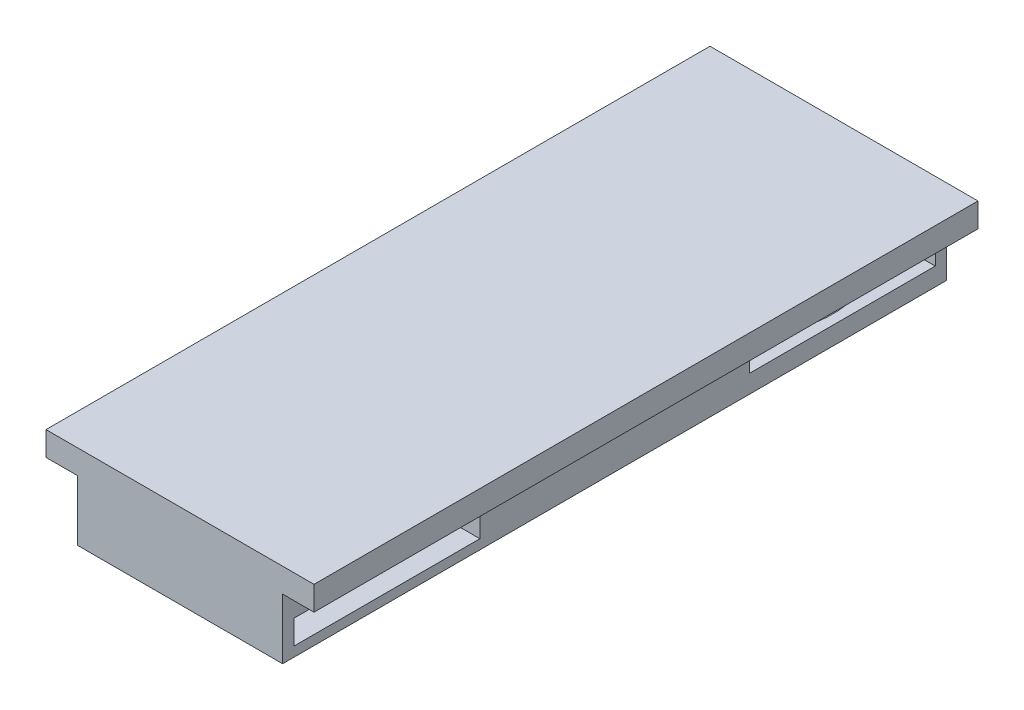
ISO-10303-21;
HEADER;
FILE_DESCRIPTION(('STEP AP214'),'2;1');
FILE_NAME('part.step','',(''),(''),'','','');
FILE_SCHEMA(('AUTOMOTIVE_DESIGN { 1 0 10303 214 1 1 1 1 }'));
ENDSEC;
DATA;
#1=APPLICATION_CONTEXT('core data for automotive mechanical design processes');
#2=APPLICATION_PROTOCOL_DEFINITION('international standard','automotive_design',2000,#1);
#3=PRODUCT_CONTEXT('',#1,'mechanical');
#4=PRODUCT('Part','Part','',(#3));
#5=PRODUCT_RELATED_PRODUCT_CATEGORY('part','',(#4));
#6=PRODUCT_DEFINITION_FORMATION('','',#4);
#7=PRODUCT_DEFINITION_CONTEXT('part definition',#1,'design');
#8=PRODUCT_DEFINITION('design','',#6,#7);
#9=PRODUCT_DEFINITION_SHAPE('','',#8);
#10=(LENGTH_UNIT() NAMED_UNIT(*) SI_UNIT(.MILLI.,.METRE.));
#11=(NAMED_UNIT(*) PLANE_ANGLE_UNIT() SI_UNIT($,.RADIAN.));
#12=(NAMED_UNIT(*) SI_UNIT($,.STERADIAN.) SOLID_ANGLE_UNIT());
#13=UNCERTAINTY_MEASURE_WITH_UNIT(LENGTH_MEASURE(1.E-05),#10,'distance_accuracy_value','');
#14=(GEOMETRIC_REPRESENTATION_CONTEXT(3) GLOBAL_UNCERTAINTY_ASSIGNED_CONTEXT((#13)) GLOBAL_UNIT_ASSIGNED_CONTEXT((#10,
#11,#12)) REPRESENTATION_CONTEXT('',''));
#15=CARTESIAN_POINT('',(0.,0.,0.));
#16=DIRECTION('',(0.,0.,1.));
#17=DIRECTION('',(1.,0.,0.));
#18=AXIS2_PLACEMENT_3D('',#15,#16,#17);
#19=CARTESIAN_POINT('',(11.1,1.01920592299446,-8.64));
#20=DIRECTION('',(0.,-1.,0.));
#21=DIRECTION('',(0.,0.,-1.));
#22=AXIS2_PLACEMENT_3D('',#19,#20,#21);
#23=CYLINDRICAL_SURFACE('',#22,7.7);
#24=DIRECTION('',(0.,-1.,0.));
#25=VECTOR('',#24,1.);
#26=CARTESIAN_POINT('',(11.1,1.01920592299446,-0.940000000000003));
#27=LINE('',#26,#25);
#28=CARTESIAN_POINT('',(11.1,1.01920592299446,-0.940000000000003));
#29=VERTEX_POINT('',#28);
#30=CARTESIAN_POINT('',(11.1,-0.980794077005543,-0.940000000000003));
#31=VERTEX_POINT('',#30);
#32=EDGE_CURVE('E160',#29,#31,#27,.T.);
#33=ORIENTED_EDGE('',*,*,#32,.T.);
#34=CARTESIAN_POINT('',(11.1,-0.980794077005544,-8.64));
#35=DIRECTION('',(0.,-1.,0.));
#36=DIRECTION('',(0.,0.,-1.));
#37=AXIS2_PLACEMENT_3D('',#34,#35,#36);
#38=CIRCLE('',#37,7.7);
#39=CARTESIAN_POINT('',(11.1,-0.980794077005543,-16.34));
#40=VERTEX_POINT('',#39);
#41=EDGE_CURVE('E173',#40,#31,#38,.F.);
#42=ORIENTED_EDGE('',*,*,#41,.F.);
#43=DIRECTION('',(0.,1.,0.));
#44=VECTOR('',#43,1.);
#45=CARTESIAN_POINT('',(11.1,1.01920592299446,-16.34));
#46=LINE('',#45,#44);
#47=CARTESIAN_POINT('',(11.1,1.01920592299446,-16.34));
#48=VERTEX_POINT('',#47);
#49=EDGE_CURVE('E168',#40,#48,#46,.T.);
#50=ORIENTED_EDGE('',*,*,#49,.T.);
#51=CARTESIAN_POINT('',(11.1,1.01920592299446,-8.64));
#52=DIRECTION('',(0.,-1.,0.));
#53=DIRECTION('',(0.,0.,-1.));
#54=AXIS2_PLACEMENT_3D('',#51,#52,#53);
#55=CIRCLE('',#54,7.7);
#56=EDGE_CURVE('E175',#29,#48,#55,.T.);
#57=ORIENTED_EDGE('',*,*,#56,.F.);
#58=EDGE_LOOP('',(#33,#42,#50,#57));
#59=FACE_BOUND('',#58,.T.);
#60=ADVANCED_FACE('F39',(#59),#23,.F.);
#61=CARTESIAN_POINT('',(11.1,1.01920592299446,-46.36));
#62=DIRECTION('',(0.,-1.,0.));
#63=DIRECTION('',(0.,0.,-1.));
#64=AXIS2_PLACEMENT_3D('',#61,#62,#63);
#65=PLANE('',#64);
#66=CARTESIAN_POINT('',(11.1,1.01920592299446,-46.36));
#67=DIRECTION('',(0.,-1.,0.));
#68=DIRECTION('',(0.,0.,-1.));
#69=AXIS2_PLACEMENT_3D('',#66,#67,#68);
#70=CIRCLE('',#69,7.7);
#71=CARTESIAN_POINT('',(11.1,1.01920592299446,-38.66));
#72=VERTEX_POINT('',#71);
#73=CARTESIAN_POINT('',(11.1,1.01920592299446,-54.06));
#74=VERTEX_POINT('',#73);
#75=EDGE_CURVE('E242',#72,#74,#70,.T.);
#76=ORIENTED_EDGE('',*,*,#75,.T.);
#77=DIRECTION('',(0.,0.,1.));
#78=VECTOR('',#77,1.);
#79=CARTESIAN_POINT('',(11.1,1.01920592299446,-46.36));
#80=LINE('',#79,#78);
#81=EDGE_CURVE('E224',#74,#72,#80,.T.);
#82=ORIENTED_EDGE('',*,*,#81,.T.);
#83=EDGE_LOOP('',(#76,#82));
#84=FACE_BOUND('',#83,.T.);
#85=ADVANCED_FACE('F375',(#84),#65,.T.);
#86=CARTESIAN_POINT('',(11.1,1.01920592299446,-46.36));
#87=DIRECTION('',(0.,-1.,0.));
#88=DIRECTION('',(0.,0.,-1.));
#89=AXIS2_PLACEMENT_3D('',#86,#87,#88);
#90=CYLINDRICAL_SURFACE('',#89,7.7);
#91=CARTESIAN_POINT('',(11.1,-0.980794077005544,-46.36));
#92=DIRECTION('',(0.,-1.,0.));
#93=DIRECTION('',(0.,0.,-1.));
#94=AXIS2_PLACEMENT_3D('',#91,#92,#93);
#95=CIRCLE('',#94,7.7);
#96=CARTESIAN_POINT('',(11.1,-0.980794077005544,-54.06));
#97=VERTEX_POINT('',#96);
#98=EDGE_CURVE('E182',#97,#97,#95,.F.);
#99=ORIENTED_EDGE('',*,*,#98,.F.);
#100=EDGE_LOOP('',(#99));
#101=FACE_BOUND('',#100,.T.);
#102=DIRECTION('',(0.,-1.,0.));
#103=VECTOR('',#102,1.);
#104=CARTESIAN_POINT('',(11.1,1.01920592299446,-38.66));
#105=LINE('',#104,#103);
#106=CARTESIAN_POINT('',(11.1,-0.280794077005543,-38.66));
#107=VERTEX_POINT('',#106);
#108=EDGE_CURVE('E11',#107,#72,#105,.F.);
#109=ORIENTED_EDGE('',*,*,#108,.F.);
#110=CARTESIAN_POINT('',(11.1,-0.280794077005543,-46.36));
#111=DIRECTION('',(0.,-1.,0.));
#112=DIRECTION('',(0.,0.,-1.));
#113=AXIS2_PLACEMENT_3D('',#110,#111,#112);
#114=CIRCLE('',#113,7.7);
#115=CARTESIAN_POINT('',(11.1,-0.280794077005543,-54.06));
#116=VERTEX_POINT('',#115);
#117=EDGE_CURVE('E48',#107,#116,#114,.F.);
#118=ORIENTED_EDGE('',*,*,#117,.T.);
#119=DIRECTION('',(0.,1.,0.));
#120=VECTOR('',#119,1.);
#121=CARTESIAN_POINT('',(11.1,1.71920592299446,-54.06));
#122=LINE('',#121,#120);
#123=EDGE_CURVE('E202',#116,#74,#122,.T.);
#124=ORIENTED_EDGE('',*,*,#123,.T.);
#125=ORIENTED_EDGE('',*,*,#75,.F.);
#126=EDGE_LOOP('',(#109,#118,#124,#125));
#127=FACE_BOUND('',#126,.T.);
#128=ADVANCED_FACE('F199',(#101,#127),#90,.F.);
#129=CARTESIAN_POINT('',(2.6,-1.78079407700554,-55.));
#130=DIRECTION('',(-1.,0.,0.));
#131=DIRECTION('',(0.,-1.,0.));
#132=AXIS2_PLACEMENT_3D('',#129,#130,#131);
#133=PLANE('',#132);
#134=DIRECTION('',(0.,-1.,0.));
#135=VECTOR('',#134,1.);
#136=CARTESIAN_POINT('',(2.6,-1.78079407700554,0.));
#137=LINE('',#136,#135);
#138=CARTESIAN_POINT('',(2.6,3.21920592299446,0.));
#139=VERTEX_POINT('',#138);
#140=CARTESIAN_POINT('',(2.6,-1.78079407700554,0.));
#141=VERTEX_POINT('',#140);
#142=EDGE_CURVE('E248',#139,#141,#137,.T.);
#143=ORIENTED_EDGE('',*,*,#142,.F.);
#144=DIRECTION('',(0.,0.,1.));
#145=VECTOR('',#144,1.);
#146=CARTESIAN_POINT('',(2.6,3.21920592299446,-55.));
#147=LINE('',#146,#145);
#148=CARTESIAN_POINT('',(2.6,3.21920592299446,-55.));
#149=VERTEX_POINT('',#148);
#150=EDGE_CURVE('E183',#149,#139,#147,.T.);
#151=ORIENTED_EDGE('',*,*,#150,.F.);
#152=DIRECTION('',(0.,-1.,0.));
#153=VECTOR('',#152,1.);
#154=CARTESIAN_POINT('',(2.6,-1.78079407700554,-55.));
#155=LINE('',#154,#153);
#156=CARTESIAN_POINT('',(2.6,-1.78079407700554,-55.));
#157=VERTEX_POINT('',#156);
#158=EDGE_CURVE('E251',#149,#157,#155,.T.);
#159=ORIENTED_EDGE('',*,*,#158,.T.);
#160=DIRECTION('',(0.,0.,1.));
#161=VECTOR('',#160,1.);
#162=CARTESIAN_POINT('',(2.6,-1.78079407700554,-55.));
#163=LINE('',#162,#161);
#164=EDGE_CURVE('E192',#157,#141,#163,.T.);
#165=ORIENTED_EDGE('',*,*,#164,.T.);
#166=EDGE_LOOP('',(#143,#151,#159,#165));
#167=FACE_BOUND('',#166,.T.);
#168=ADVANCED_FACE('F41',(#167),#133,.T.);
#169=CARTESIAN_POINT('',(2.6,3.21920592299446,-55.));
#170=DIRECTION('',(0.,-1.,0.));
#171=DIRECTION('',(1.,0.,0.));
#172=AXIS2_PLACEMENT_3D('',#169,#170,#171);
#173=PLANE('',#172);
#174=DIRECTION('',(1.,0.,0.));
#175=VECTOR('',#174,1.);
#176=CARTESIAN_POINT('',(2.6,3.21920592299446,0.));
#177=LINE('',#176,#175);
#178=CARTESIAN_POINT('',(0.,3.21920592299446,0.));
#179=VERTEX_POINT('',#178);
#180=EDGE_CURVE('E256',#179,#139,#177,.T.);
#181=ORIENTED_EDGE('',*,*,#180,.F.);
#182=DIRECTION('',(0.,0.,1.));
#183=VECTOR('',#182,1.);
#184=CARTESIAN_POINT('',(0.,3.21920592299446,-55.));
#185=LINE('',#184,#183);
#186=CARTESIAN_POINT('',(0.,3.21920592299446,-55.));
#187=VERTEX_POINT('',#186);
#188=EDGE_CURVE('E189',#187,#179,#185,.T.);
#189=ORIENTED_EDGE('',*,*,#188,.F.);
#190=DIRECTION('',(1.,0.,0.));
#191=VECTOR('',#190,1.);
#192=CARTESIAN_POINT('',(2.6,3.21920592299446,-55.));
#193=LINE('',#192,#191);
#194=EDGE_CURVE('E280',#187,#149,#193,.T.);
#195=ORIENTED_EDGE('',*,*,#194,.T.);
#196=ORIENTED_EDGE('',*,*,#150,.T.);
#197=EDGE_LOOP('',(#181,#189,#195,#196));
#198=FACE_BOUND('',#197,.T.);
#199=ADVANCED_FACE('F344',(#198),#173,.T.);
#200=CARTESIAN_POINT('',(0.,3.21920592299446,-55.));
#201=DIRECTION('',(-1.,0.,0.));
#202=DIRECTION('',(0.,0.,1.));
#203=AXIS2_PLACEMENT_3D('',#200,#201,#202);
#204=PLANE('',#203);
#205=DIRECTION('',(0.,-1.,0.));
#206=VECTOR('',#205,1.);
#207=CARTESIAN_POINT('',(0.,3.21920592299446,0.));
#208=LINE('',#207,#206);
#209=CARTESIAN_POINT('',(0.,5.21920592299446,0.));
#210=VERTEX_POINT('',#209);
#211=EDGE_CURVE('E307',#210,#179,#208,.T.);
#212=ORIENTED_EDGE('',*,*,#211,.F.);
#213=DIRECTION('',(0.,0.,1.));
#214=VECTOR('',#213,1.);
#215=CARTESIAN_POINT('',(0.,5.21920592299446,-55.));
#216=LINE('',#215,#214);
#217=CARTESIAN_POINT('',(0.,5.21920592299446,-55.));
#218=VERTEX_POINT('',#217);
#219=EDGE_CURVE('E316',#218,#210,#216,.T.);
#220=ORIENTED_EDGE('',*,*,#219,.F.);
#221=DIRECTION('',(0.,-1.,0.));
#222=VECTOR('',#221,1.);
#223=CARTESIAN_POINT('',(0.,3.21920592299446,-55.));
#224=LINE('',#223,#222);
#225=EDGE_CURVE('E276',#218,#187,#224,.T.);
#226=ORIENTED_EDGE('',*,*,#225,.T.);
#227=ORIENTED_EDGE('',*,*,#188,.T.);
#228=EDGE_LOOP('',(#212,#220,#226,#227));
#229=FACE_BOUND('',#228,.T.);
#230=ADVANCED_FACE('F365',(#229),#204,.T.);
#231=CARTESIAN_POINT('',(0.,5.21920592299446,-55.));
#232=DIRECTION('',(0.,1.,0.));
#233=DIRECTION('',(-1.,0.,0.));
#234=AXIS2_PLACEMENT_3D('',#231,#232,#233);
#235=PLANE('',#234);
#236=DIRECTION('',(-1.,0.,0.));
#237=VECTOR('',#236,1.);
#238=CARTESIAN_POINT('',(0.,5.21920592299446,0.));
#239=LINE('',#238,#237);
#240=CARTESIAN_POINT('',(22.2,5.21920592299446,0.));
#241=VERTEX_POINT('',#240);
#242=EDGE_CURVE('E303',#241,#210,#239,.T.);
#243=ORIENTED_EDGE('',*,*,#242,.F.);
#244=DIRECTION('',(0.,0.,1.));
#245=VECTOR('',#244,1.);
#246=CARTESIAN_POINT('',(22.2,5.21920592299446,-55.));
#247=LINE('',#246,#245);
#248=CARTESIAN_POINT('',(22.2,5.21920592299446,-55.));
#249=VERTEX_POINT('',#248);
#250=EDGE_CURVE('E319',#249,#241,#247,.T.);
#251=ORIENTED_EDGE('',*,*,#250,.F.);
#252=DIRECTION('',(-1.,0.,0.));
#253=VECTOR('',#252,1.);
#254=CARTESIAN_POINT('',(0.,5.21920592299446,-55.));
#255=LINE('',#254,#253);
#256=EDGE_CURVE('E272',#249,#218,#255,.T.);
#257=ORIENTED_EDGE('',*,*,#256,.T.);
#258=ORIENTED_EDGE('',*,*,#219,.T.);
#259=EDGE_LOOP('',(#243,#251,#257,#258));
#260=FACE_BOUND('',#259,.T.);
#261=ADVANCED_FACE('F363',(#260),#235,.T.);
#262=CARTESIAN_POINT('',(22.2,5.21920592299446,-55.));
#263=DIRECTION('',(1.,0.,0.));
#264=DIRECTION('',(0.,0.,-1.));
#265=AXIS2_PLACEMENT_3D('',#262,#263,#264);
#266=PLANE('',#265);
#267=DIRECTION('',(0.,1.,0.));
#268=VECTOR('',#267,1.);
#269=CARTESIAN_POINT('',(22.2,5.21920592299446,0.));
#270=LINE('',#269,#268);
#271=CARTESIAN_POINT('',(22.2,3.21920592299446,0.));
#272=VERTEX_POINT('',#271);
#273=EDGE_CURVE('E299',#272,#241,#270,.T.);
#274=ORIENTED_EDGE('',*,*,#273,.F.);
#275=DIRECTION('',(0.,0.,1.));
#276=VECTOR('',#275,1.);
#277=CARTESIAN_POINT('',(22.2,3.21920592299446,-55.));
#278=LINE('',#277,#276);
#279=CARTESIAN_POINT('',(22.2,3.21920592299446,-55.));
#280=VERTEX_POINT('',#279);
#281=EDGE_CURVE('E322',#280,#272,#278,.T.);
#282=ORIENTED_EDGE('',*,*,#281,.F.);
#283=DIRECTION('',(0.,1.,0.));
#284=VECTOR('',#283,1.);
#285=CARTESIAN_POINT('',(22.2,5.21920592299446,-55.));
#286=LINE('',#285,#284);
#287=EDGE_CURVE('E268',#280,#249,#286,.T.);
#288=ORIENTED_EDGE('',*,*,#287,.T.);
#289=ORIENTED_EDGE('',*,*,#250,.T.);
#290=EDGE_LOOP('',(#274,#282,#288,#289));
#291=FACE_BOUND('',#290,.T.);
#292=ADVANCED_FACE('F359',(#291),#266,.T.);
#293=CARTESIAN_POINT('',(22.2,3.21920592299446,-55.));
#294=DIRECTION('',(0.,-1.,0.));
#295=DIRECTION('',(1.,0.,0.));
#296=AXIS2_PLACEMENT_3D('',#293,#294,#295);
#297=PLANE('',#296);
#298=DIRECTION('',(1.,0.,0.));
#299=VECTOR('',#298,1.);
#300=CARTESIAN_POINT('',(22.2,3.21920592299446,0.));
#301=LINE('',#300,#299);
#302=CARTESIAN_POINT('',(19.6,3.21920592299446,0.));
#303=VERTEX_POINT('',#302);
#304=EDGE_CURVE('E295',#303,#272,#301,.T.);
#305=ORIENTED_EDGE('',*,*,#304,.F.);
#306=DIRECTION('',(0.,0.,1.));
#307=VECTOR('',#306,1.);
#308=CARTESIAN_POINT('',(19.6,3.21920592299446,-55.));
#309=LINE('',#308,#307);
#310=CARTESIAN_POINT('',(19.6,3.21920592299446,-55.));
#311=VERTEX_POINT('',#310);
#312=EDGE_CURVE('E325',#311,#303,#309,.T.);
#313=ORIENTED_EDGE('',*,*,#312,.F.);
#314=DIRECTION('',(1.,0.,0.));
#315=VECTOR('',#314,1.);
#316=CARTESIAN_POINT('',(22.2,3.21920592299446,-55.));
#317=LINE('',#316,#315);
#318=EDGE_CURVE('E264',#311,#280,#317,.T.);
#319=ORIENTED_EDGE('',*,*,#318,.T.);
#320=ORIENTED_EDGE('',*,*,#281,.T.);
#321=EDGE_LOOP('',(#305,#313,#319,#320));
#322=FACE_BOUND('',#321,.T.);
#323=ADVANCED_FACE('F357',(#322),#297,.T.);
#324=CARTESIAN_POINT('',(19.6,-1.78079407700554,-55.));
#325=DIRECTION('',(1.,0.,0.));
#326=DIRECTION('',(0.,0.,-1.));
#327=AXIS2_PLACEMENT_3D('',#324,#325,#326);
#328=PLANE('',#327);
#329=DIRECTION('',(0.,-1.,0.));
#330=VECTOR('',#329,1.);
#331=CARTESIAN_POINT('',(19.6,1.01920592299446,-0.940000000000003));
#332=LINE('',#331,#330);
#333=CARTESIAN_POINT('',(19.6,1.01920592299446,-0.940000000000003));
#334=VERTEX_POINT('',#333);
#335=CARTESIAN_POINT('',(19.6,-0.980794077005543,-0.940000000000003));
#336=VERTEX_POINT('',#335);
#337=EDGE_CURVE('E55',#334,#336,#332,.T.);
#338=ORIENTED_EDGE('',*,*,#337,.F.);
#339=DIRECTION('',(0.,0.,1.));
#340=VECTOR('',#339,1.);
#341=CARTESIAN_POINT('',(19.6,1.01920592299446,-0.940000000000003));
#342=LINE('',#341,#340);
#343=CARTESIAN_POINT('',(19.6,1.01920592299446,-16.34));
#344=VERTEX_POINT('',#343);
#345=EDGE_CURVE('E177',#344,#334,#342,.T.);
#346=ORIENTED_EDGE('',*,*,#345,.F.);
#347=DIRECTION('',(0.,1.,0.));
#348=VECTOR('',#347,1.);
#349=CARTESIAN_POINT('',(19.6,1.01920592299446,-16.34));
#350=LINE('',#349,#348);
#351=CARTESIAN_POINT('',(19.6,-0.980794077005543,-16.34));
#352=VERTEX_POINT('',#351);
#353=EDGE_CURVE('E436',#352,#344,#350,.T.);
#354=ORIENTED_EDGE('',*,*,#353,.F.);
#355=DIRECTION('',(0.,0.,-1.));
#356=VECTOR('',#355,1.);
#357=CARTESIAN_POINT('',(19.6,-0.980794077005543,-0.940000000000003));
#358=LINE('',#357,#356);
#359=EDGE_CURVE('E441',#336,#352,#358,.T.);
#360=ORIENTED_EDGE('',*,*,#359,.F.);
#361=EDGE_LOOP('',(#338,#346,#354,#360));
#362=FACE_BOUND('',#361,.T.);
#363=DIRECTION('',(0.,-1.,0.));
#364=VECTOR('',#363,1.);
#365=CARTESIAN_POINT('',(19.6,1.71920592299446,-38.66));
#366=LINE('',#365,#364);
#367=CARTESIAN_POINT('',(19.6,1.71920592299446,-38.66));
#368=VERTEX_POINT('',#367);
#369=CARTESIAN_POINT('',(19.6,-0.280794077005543,-38.66));
#370=VERTEX_POINT('',#369);
#371=EDGE_CURVE('E63',#368,#370,#366,.T.);
#372=ORIENTED_EDGE('',*,*,#371,.F.);
#373=DIRECTION('',(0.,0.,1.));
#374=VECTOR('',#373,1.);
#375=CARTESIAN_POINT('',(19.6,1.71920592299446,-38.66));
#376=LINE('',#375,#374);
#377=CARTESIAN_POINT('',(19.6,1.71920592299446,-54.06));
#378=VERTEX_POINT('',#377);
#379=EDGE_CURVE('E460',#378,#368,#376,.T.);
#380=ORIENTED_EDGE('',*,*,#379,.F.);
#381=DIRECTION('',(0.,1.,0.));
#382=VECTOR('',#381,1.);
#383=CARTESIAN_POINT('',(19.6,1.71920592299446,-54.06));
#384=LINE('',#383,#382);
#385=CARTESIAN_POINT('',(19.6,-0.280794077005543,-54.06));
#386=VERTEX_POINT('',#385);
#387=EDGE_CURVE('E468',#386,#378,#384,.T.);
#388=ORIENTED_EDGE('',*,*,#387,.F.);
#389=DIRECTION('',(0.,0.,-1.));
#390=VECTOR('',#389,1.);
#391=CARTESIAN_POINT('',(19.6,-0.280794077005543,-38.66));
#392=LINE('',#391,#390);
#393=EDGE_CURVE('E465',#370,#386,#392,.T.);
#394=ORIENTED_EDGE('',*,*,#393,.F.);
#395=EDGE_LOOP('',(#372,#380,#388,#394));
#396=FACE_BOUND('',#395,.T.);
#397=DIRECTION('',(0.,1.,0.));
#398=VECTOR('',#397,1.);
#399=CARTESIAN_POINT('',(19.6,-1.78079407700554,0.));
#400=LINE('',#399,#398);
#401=CARTESIAN_POINT('',(19.6,-1.78079407700554,0.));
#402=VERTEX_POINT('',#401);
#403=EDGE_CURVE('E291',#402,#303,#400,.T.);
#404=ORIENTED_EDGE('',*,*,#403,.F.);
#405=DIRECTION('',(0.,0.,1.));
#406=VECTOR('',#405,1.);
#407=CARTESIAN_POINT('',(19.6,-1.78079407700554,-55.));
#408=LINE('',#407,#406);
#409=CARTESIAN_POINT('',(19.6,-1.78079407700554,-55.));
#410=VERTEX_POINT('',#409);
#411=EDGE_CURVE('E327',#410,#402,#408,.T.);
#412=ORIENTED_EDGE('',*,*,#411,.F.);
#413=DIRECTION('',(0.,1.,0.));
#414=VECTOR('',#413,1.);
#415=CARTESIAN_POINT('',(19.6,-1.78079407700554,-55.));
#416=LINE('',#415,#414);
#417=EDGE_CURVE('E260',#410,#311,#416,.T.);
#418=ORIENTED_EDGE('',*,*,#417,.T.);
#419=ORIENTED_EDGE('',*,*,#312,.T.);
#420=EDGE_LOOP('',(#404,#412,#418,#419));
#421=FACE_BOUND('',#420,.T.);
#422=ADVANCED_FACE('F353',(#362,#396,#421),#328,.T.);
#423=CARTESIAN_POINT('',(2.6,-1.78079407700554,-55.));
#424=DIRECTION('',(0.,-1.,0.));
#425=DIRECTION('',(1.,0.,0.));
#426=AXIS2_PLACEMENT_3D('',#423,#424,#425);
#427=PLANE('',#426);
#428=DIRECTION('',(1.,0.,0.));
#429=VECTOR('',#428,1.);
#430=CARTESIAN_POINT('',(2.6,-1.78079407700554,0.));
#431=LINE('',#430,#429);
#432=EDGE_CURVE('E287',#141,#402,#431,.T.);
#433=ORIENTED_EDGE('',*,*,#432,.F.);
#434=ORIENTED_EDGE('',*,*,#164,.F.);
#435=DIRECTION('',(1.,0.,0.));
#436=VECTOR('',#435,1.);
#437=CARTESIAN_POINT('',(2.6,-1.78079407700554,-55.));
#438=LINE('',#437,#436);
#439=EDGE_CURVE('E255',#157,#410,#438,.T.);
#440=ORIENTED_EDGE('',*,*,#439,.T.);
#441=ORIENTED_EDGE('',*,*,#411,.T.);
#442=EDGE_LOOP('',(#433,#434,#440,#441));
#443=FACE_BOUND('',#442,.T.);
#444=CARTESIAN_POINT('',(11.1,-1.78079407700554,-8.64));
#445=DIRECTION('',(0.,-1.,0.));
#446=DIRECTION('',(0.,0.,-1.));
#447=AXIS2_PLACEMENT_3D('',#444,#445,#446);
#448=CIRCLE('',#447,5.5);
#449=CARTESIAN_POINT('',(11.1,-1.78079407700554,-14.14));
#450=VERTEX_POINT('',#449);
#451=EDGE_CURVE('E234',#450,#450,#448,.T.);
#452=ORIENTED_EDGE('',*,*,#451,.F.);
#453=EDGE_LOOP('',(#452));
#454=FACE_BOUND('',#453,.T.);
#455=CARTESIAN_POINT('',(11.1,-1.78079407700554,-46.36));
#456=DIRECTION('',(0.,-1.,0.));
#457=DIRECTION('',(0.,0.,-1.));
#458=AXIS2_PLACEMENT_3D('',#455,#456,#457);
#459=CIRCLE('',#458,5.5);
#460=CARTESIAN_POINT('',(11.1,-1.78079407700554,-51.86));
#461=VERTEX_POINT('',#460);
#462=EDGE_CURVE('E228',#461,#461,#459,.T.);
#463=ORIENTED_EDGE('',*,*,#462,.F.);
#464=EDGE_LOOP('',(#463));
#465=FACE_BOUND('',#464,.T.);
#466=ADVANCED_FACE('F337',(#443,#454,#465),#427,.T.);
#467=CARTESIAN_POINT('',(0.,0.,-55.));
#468=DIRECTION('',(0.,0.,1.));
#469=DIRECTION('',(1.,0.,0.));
#470=AXIS2_PLACEMENT_3D('',#467,#468,#469);
#471=PLANE('',#470);
#472=ORIENTED_EDGE('',*,*,#158,.F.);
#473=ORIENTED_EDGE('',*,*,#194,.F.);
#474=ORIENTED_EDGE('',*,*,#225,.F.);
#475=ORIENTED_EDGE('',*,*,#256,.F.);
#476=ORIENTED_EDGE('',*,*,#287,.F.);
#477=ORIENTED_EDGE('',*,*,#318,.F.);
#478=ORIENTED_EDGE('',*,*,#417,.F.);
#479=ORIENTED_EDGE('',*,*,#439,.F.);
#480=EDGE_LOOP('',(#472,#473,#474,#475,#476,#477,#478,#479));
#481=FACE_BOUND('',#480,.T.);
#482=ADVANCED_FACE('F347',(#481),#471,.F.);
#483=CARTESIAN_POINT('',(0.,0.,0.));
#484=DIRECTION('',(0.,0.,1.));
#485=DIRECTION('',(1.,0.,0.));
#486=AXIS2_PLACEMENT_3D('',#483,#484,#485);
#487=PLANE('',#486);
#488=ORIENTED_EDGE('',*,*,#142,.T.);
#489=ORIENTED_EDGE('',*,*,#432,.T.);
#490=ORIENTED_EDGE('',*,*,#403,.T.);
#491=ORIENTED_EDGE('',*,*,#304,.T.);
#492=ORIENTED_EDGE('',*,*,#273,.T.);
#493=ORIENTED_EDGE('',*,*,#242,.T.);
#494=ORIENTED_EDGE('',*,*,#211,.T.);
#495=ORIENTED_EDGE('',*,*,#180,.T.);
#496=EDGE_LOOP('',(#488,#489,#490,#491,#492,#493,#494,#495));
#497=FACE_BOUND('',#496,.T.);
#498=ADVANCED_FACE('F340',(#497),#487,.T.);
#499=CARTESIAN_POINT('',(11.1,-0.980794077005544,-8.64));
#500=DIRECTION('',(0.,-1.,0.));
#501=DIRECTION('',(0.,0.,-1.));
#502=AXIS2_PLACEMENT_3D('',#499,#500,#501);
#503=PLANE('',#502);
#504=CARTESIAN_POINT('',(11.1,-0.980794077005544,-8.64));
#505=DIRECTION('',(0.,-1.,0.));
#506=DIRECTION('',(0.,0.,-1.));
#507=AXIS2_PLACEMENT_3D('',#504,#505,#506);
#508=CIRCLE('',#507,5.5);
#509=CARTESIAN_POINT('',(11.1,-0.980794077005544,-14.14));
#510=VERTEX_POINT('',#509);
#511=EDGE_CURVE('E238',#510,#510,#508,.T.);
#512=ORIENTED_EDGE('',*,*,#511,.T.);
#513=EDGE_LOOP('',(#512));
#514=FACE_BOUND('',#513,.T.);
#515=DIRECTION('',(1.,0.,0.));
#516=VECTOR('',#515,1.);
#517=CARTESIAN_POINT('',(11.1,-0.980794077005543,-16.34));
#518=LINE('',#517,#516);
#519=EDGE_CURVE('E167',#40,#352,#518,.T.);
#520=ORIENTED_EDGE('',*,*,#519,.F.);
#521=ORIENTED_EDGE('',*,*,#41,.T.);
#522=DIRECTION('',(1.,0.,0.));
#523=VECTOR('',#522,1.);
#524=CARTESIAN_POINT('',(11.1,-0.980794077005543,-0.940000000000003));
#525=LINE('',#524,#523);
#526=EDGE_CURVE('E157',#31,#336,#525,.T.);
#527=ORIENTED_EDGE('',*,*,#526,.T.);
#528=ORIENTED_EDGE('',*,*,#359,.T.);
#529=EDGE_LOOP('',(#520,#521,#527,#528));
#530=FACE_BOUND('',#529,.T.);
#531=ADVANCED_FACE('F179',(#514,#530),#503,.F.);
#532=CARTESIAN_POINT('',(11.1,-0.980794077005544,-8.64));
#533=DIRECTION('',(0.,-1.,0.));
#534=DIRECTION('',(0.,0.,-1.));
#535=AXIS2_PLACEMENT_3D('',#532,#533,#534);
#536=CYLINDRICAL_SURFACE('',#535,5.5);
#537=ORIENTED_EDGE('',*,*,#511,.F.);
#538=EDGE_LOOP('',(#537));
#539=FACE_BOUND('',#538,.T.);
#540=ORIENTED_EDGE('',*,*,#451,.T.);
#541=EDGE_LOOP('',(#540));
#542=FACE_BOUND('',#541,.T.);
#543=ADVANCED_FACE('F395',(#539,#542),#536,.F.);
#544=CARTESIAN_POINT('',(11.1,1.01920592299446,-8.64));
#545=DIRECTION('',(0.,-1.,0.));
#546=DIRECTION('',(0.,0.,-1.));
#547=AXIS2_PLACEMENT_3D('',#544,#545,#546);
#548=PLANE('',#547);
#549=DIRECTION('',(1.,0.,0.));
#550=VECTOR('',#549,1.);
#551=CARTESIAN_POINT('',(11.1,1.01920592299446,-0.940000000000003));
#552=LINE('',#551,#550);
#553=EDGE_CURVE('E229',#29,#334,#552,.T.);
#554=ORIENTED_EDGE('',*,*,#553,.F.);
#555=ORIENTED_EDGE('',*,*,#56,.T.);
#556=DIRECTION('',(1.,0.,0.));
#557=VECTOR('',#556,1.);
#558=CARTESIAN_POINT('',(11.1,1.01920592299446,-16.34));
#559=LINE('',#558,#557);
#560=EDGE_CURVE('E438',#48,#344,#559,.T.);
#561=ORIENTED_EDGE('',*,*,#560,.T.);
#562=ORIENTED_EDGE('',*,*,#345,.T.);
#563=EDGE_LOOP('',(#554,#555,#561,#562));
#564=FACE_BOUND('',#563,.T.);
#565=ADVANCED_FACE('F383',(#564),#548,.T.);
#566=CARTESIAN_POINT('',(11.1,-0.980794077005544,-46.36));
#567=DIRECTION('',(0.,-1.,0.));
#568=DIRECTION('',(0.,0.,-1.));
#569=AXIS2_PLACEMENT_3D('',#566,#567,#568);
#570=PLANE('',#569);
#571=CARTESIAN_POINT('',(11.1,-0.980794077005544,-46.36));
#572=DIRECTION('',(0.,-1.,0.));
#573=DIRECTION('',(0.,0.,-1.));
#574=AXIS2_PLACEMENT_3D('',#571,#572,#573);
#575=CIRCLE('',#574,5.5);
#576=CARTESIAN_POINT('',(11.1,-0.980794077005544,-51.86));
#577=VERTEX_POINT('',#576);
#578=EDGE_CURVE('E230',#577,#577,#575,.T.);
#579=ORIENTED_EDGE('',*,*,#578,.T.);
#580=EDGE_LOOP('',(#579));
#581=FACE_BOUND('',#580,.T.);
#582=ORIENTED_EDGE('',*,*,#98,.T.);
#583=EDGE_LOOP('',(#582));
#584=FACE_BOUND('',#583,.T.);
#585=ADVANCED_FACE('F403',(#581,#584),#570,.F.);
#586=CARTESIAN_POINT('',(11.1,-0.980794077005544,-46.36));
#587=DIRECTION('',(0.,-1.,0.));
#588=DIRECTION('',(0.,0.,-1.));
#589=AXIS2_PLACEMENT_3D('',#586,#587,#588);
#590=CYLINDRICAL_SURFACE('',#589,5.5);
#591=ORIENTED_EDGE('',*,*,#578,.F.);
#592=EDGE_LOOP('',(#591));
#593=FACE_BOUND('',#592,.T.);
#594=ORIENTED_EDGE('',*,*,#462,.T.);
#595=EDGE_LOOP('',(#594));
#596=FACE_BOUND('',#595,.T.);
#597=ADVANCED_FACE('F406',(#593,#596),#590,.F.);
#598=CARTESIAN_POINT('',(11.1,-0.280794077005543,-38.66));
#599=DIRECTION('',(0.,-1.,0.));
#600=DIRECTION('',(0.,0.,-1.));
#601=AXIS2_PLACEMENT_3D('',#598,#599,#600);
#602=PLANE('',#601);
#603=DIRECTION('',(1.,0.,0.));
#604=VECTOR('',#603,1.);
#605=CARTESIAN_POINT('',(11.1,-0.280794077005543,-38.66));
#606=LINE('',#605,#604);
#607=EDGE_CURVE('E207',#107,#370,#606,.T.);
#608=ORIENTED_EDGE('',*,*,#607,.T.);
#609=ORIENTED_EDGE('',*,*,#393,.T.);
#610=DIRECTION('',(1.,0.,0.));
#611=VECTOR('',#610,1.);
#612=CARTESIAN_POINT('',(11.1,-0.280794077005543,-54.06));
#613=LINE('',#612,#611);
#614=EDGE_CURVE('E209',#116,#386,#613,.T.);
#615=ORIENTED_EDGE('',*,*,#614,.F.);
#616=ORIENTED_EDGE('',*,*,#117,.F.);
#617=EDGE_LOOP('',(#608,#609,#615,#616));
#618=FACE_BOUND('',#617,.T.);
#619=ADVANCED_FACE('F205',(#618),#602,.F.);
#620=CARTESIAN_POINT('',(11.1,1.71920592299446,-38.66));
#621=DIRECTION('',(0.,0.,1.));
#622=DIRECTION('',(1.,0.,0.));
#623=AXIS2_PLACEMENT_3D('',#620,#621,#622);
#624=PLANE('',#623);
#625=ORIENTED_EDGE('',*,*,#371,.T.);
#626=ORIENTED_EDGE('',*,*,#607,.F.);
#627=ORIENTED_EDGE('',*,*,#108,.T.);
#628=DIRECTION('',(0.,-1.,0.));
#629=VECTOR('',#628,1.);
#630=CARTESIAN_POINT('',(11.1,1.71920592299446,-38.66));
#631=LINE('',#630,#629);
#632=CARTESIAN_POINT('',(11.1,1.71920592299446,-38.66));
#633=VERTEX_POINT('',#632);
#634=EDGE_CURVE('E456',#633,#72,#631,.T.);
#635=ORIENTED_EDGE('',*,*,#634,.F.);
#636=DIRECTION('',(1.,0.,0.));
#637=VECTOR('',#636,1.);
#638=CARTESIAN_POINT('',(11.1,1.71920592299446,-38.66));
#639=LINE('',#638,#637);
#640=EDGE_CURVE('E475',#633,#368,#639,.T.);
#641=ORIENTED_EDGE('',*,*,#640,.T.);
#642=EDGE_LOOP('',(#625,#626,#627,#635,#641));
#643=FACE_BOUND('',#642,.T.);
#644=ADVANCED_FACE('F210',(#643),#624,.F.);
#645=CARTESIAN_POINT('',(11.1,1.71920592299446,-38.66));
#646=DIRECTION('',(0.,1.,0.));
#647=DIRECTION('',(0.,0.,1.));
#648=AXIS2_PLACEMENT_3D('',#645,#646,#647);
#649=PLANE('',#648);
#650=ORIENTED_EDGE('',*,*,#379,.T.);
#651=ORIENTED_EDGE('',*,*,#640,.F.);
#652=DIRECTION('',(0.,0.,1.));
#653=VECTOR('',#652,1.);
#654=CARTESIAN_POINT('',(11.1,1.71920592299446,-38.66));
#655=LINE('',#654,#653);
#656=CARTESIAN_POINT('',(11.1,1.71920592299446,-54.06));
#657=VERTEX_POINT('',#656);
#658=EDGE_CURVE('E214',#657,#633,#655,.T.);
#659=ORIENTED_EDGE('',*,*,#658,.F.);
#660=DIRECTION('',(1.,0.,0.));
#661=VECTOR('',#660,1.);
#662=CARTESIAN_POINT('',(11.1,1.71920592299446,-54.06));
#663=LINE('',#662,#661);
#664=EDGE_CURVE('E218',#657,#378,#663,.T.);
#665=ORIENTED_EDGE('',*,*,#664,.T.);
#666=EDGE_LOOP('',(#650,#651,#659,#665));
#667=FACE_BOUND('',#666,.T.);
#668=ADVANCED_FACE('F413',(#667),#649,.F.);
#669=CARTESIAN_POINT('',(11.1,1.71920592299446,-54.06));
#670=DIRECTION('',(0.,0.,-1.));
#671=DIRECTION('',(-1.,0.,0.));
#672=AXIS2_PLACEMENT_3D('',#669,#670,#671);
#673=PLANE('',#672);
#674=ORIENTED_EDGE('',*,*,#387,.T.);
#675=ORIENTED_EDGE('',*,*,#664,.F.);
#676=EDGE_CURVE('E459',#74,#657,#122,.T.);
#677=ORIENTED_EDGE('',*,*,#676,.F.);
#678=ORIENTED_EDGE('',*,*,#123,.F.);
#679=ORIENTED_EDGE('',*,*,#614,.T.);
#680=EDGE_LOOP('',(#674,#675,#677,#678,#679));
#681=FACE_BOUND('',#680,.T.);
#682=ADVANCED_FACE('F416',(#681),#673,.F.);
#683=CARTESIAN_POINT('',(11.1,0.,0.));
#684=DIRECTION('',(1.,0.,0.));
#685=DIRECTION('',(0.,0.,-1.));
#686=AXIS2_PLACEMENT_3D('',#683,#684,#685);
#687=PLANE('',#686);
#688=ORIENTED_EDGE('',*,*,#676,.T.);
#689=ORIENTED_EDGE('',*,*,#658,.T.);
#690=ORIENTED_EDGE('',*,*,#634,.T.);
#691=ORIENTED_EDGE('',*,*,#81,.F.);
#692=EDGE_LOOP('',(#688,#689,#690,#691));
#693=FACE_BOUND('',#692,.T.);
#694=ADVANCED_FACE('F419',(#693),#687,.T.);
#695=CARTESIAN_POINT('',(11.1,1.01920592299446,-0.940000000000003));
#696=DIRECTION('',(0.,0.,1.));
#697=DIRECTION('',(0.,-1.,0.));
#698=AXIS2_PLACEMENT_3D('',#695,#696,#697);
#699=PLANE('',#698);
#700=ORIENTED_EDGE('',*,*,#337,.T.);
#701=ORIENTED_EDGE('',*,*,#526,.F.);
#702=ORIENTED_EDGE('',*,*,#32,.F.);
#703=ORIENTED_EDGE('',*,*,#553,.T.);
#704=EDGE_LOOP('',(#700,#701,#702,#703));
#705=FACE_BOUND('',#704,.T.);
#706=ADVANCED_FACE('F159',(#705),#699,.F.);
#707=CARTESIAN_POINT('',(11.1,1.01920592299446,-16.34));
#708=DIRECTION('',(0.,0.,-1.));
#709=DIRECTION('',(-1.,0.,0.));
#710=AXIS2_PLACEMENT_3D('',#707,#708,#709);
#711=PLANE('',#710);
#712=ORIENTED_EDGE('',*,*,#353,.T.);
#713=ORIENTED_EDGE('',*,*,#560,.F.);
#714=ORIENTED_EDGE('',*,*,#49,.F.);
#715=ORIENTED_EDGE('',*,*,#519,.T.);
#716=EDGE_LOOP('',(#712,#713,#714,#715));
#717=FACE_BOUND('',#716,.T.);
#718=ADVANCED_FACE('F429',(#717),#711,.F.);
#719=CLOSED_SHELL('',(#60,#85,#128,#168,#199,#230,#261,#292,#323,#422,#466,#482,#498,#531,#543,
#565,#585,#597,#619,#644,#668,#682,#694,#706,#718));
#720=MANIFOLD_SOLID_BREP('B2',#719);
#721=ADVANCED_BREP_SHAPE_REPRESENTATION('',(#18,#720),#14);
#722=SHAPE_DEFINITION_REPRESENTATION(#9,#721);
ENDSEC;
END-ISO-10303-21;
